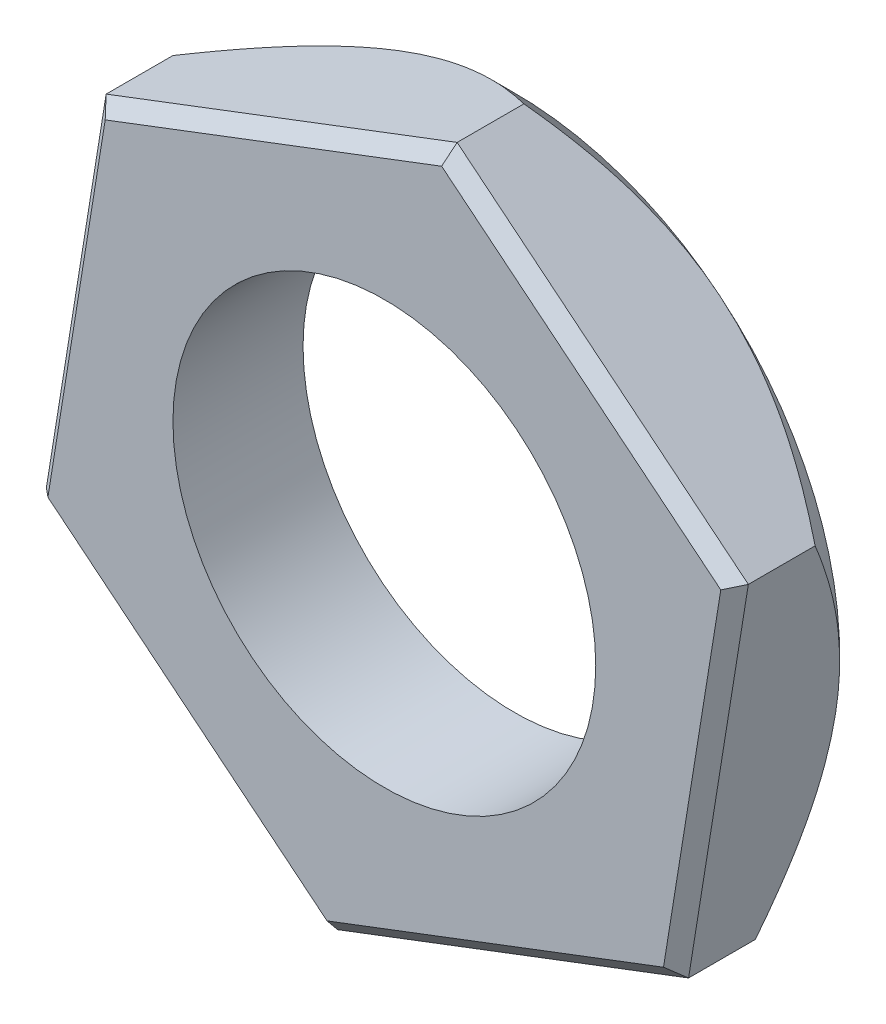
ISO-10303-21;
HEADER;
FILE_DESCRIPTION(('STEP AP214'),'2;1');
FILE_NAME('part.step','',(''),(''),'','','');
FILE_SCHEMA(('AUTOMOTIVE_DESIGN { 1 0 10303 214 1 1 1 1 }'));
ENDSEC;
DATA;
#1=APPLICATION_CONTEXT('core data for automotive mechanical design processes');
#2=APPLICATION_PROTOCOL_DEFINITION('international standard','automotive_design',2000,#1);
#3=PRODUCT_CONTEXT('',#1,'mechanical');
#4=PRODUCT('Part','Part','',(#3));
#5=PRODUCT_RELATED_PRODUCT_CATEGORY('part','',(#4));
#6=PRODUCT_DEFINITION_FORMATION('','',#4);
#7=PRODUCT_DEFINITION_CONTEXT('part definition',#1,'design');
#8=PRODUCT_DEFINITION('design','',#6,#7);
#9=PRODUCT_DEFINITION_SHAPE('','',#8);
#10=(LENGTH_UNIT() NAMED_UNIT(*) SI_UNIT(.MILLI.,.METRE.));
#11=(NAMED_UNIT(*) PLANE_ANGLE_UNIT() SI_UNIT($,.RADIAN.));
#12=(NAMED_UNIT(*) SI_UNIT($,.STERADIAN.) SOLID_ANGLE_UNIT());
#13=UNCERTAINTY_MEASURE_WITH_UNIT(LENGTH_MEASURE(1.E-05),#10,'distance_accuracy_value','');
#14=(GEOMETRIC_REPRESENTATION_CONTEXT(3) GLOBAL_UNCERTAINTY_ASSIGNED_CONTEXT((#13)) GLOBAL_UNIT_ASSIGNED_CONTEXT((#10,
#11,#12)) REPRESENTATION_CONTEXT('',''));
#15=CARTESIAN_POINT('',(0.,0.,0.));
#16=DIRECTION('',(0.,0.,1.));
#17=DIRECTION('',(1.,0.,0.));
#18=AXIS2_PLACEMENT_3D('',#15,#16,#17);
#19=CARTESIAN_POINT('',(0.,0.,0.));
#20=DIRECTION('',(0.,0.,1.));
#21=DIRECTION('',(1.,0.,0.));
#22=AXIS2_PLACEMENT_3D('',#19,#20,#21);
#23=PLANE('',#22);
#24=CARTESIAN_POINT('',(0.,0.,0.));
#25=DIRECTION('',(0.,0.,1.));
#26=DIRECTION('',(1.,0.,0.));
#27=AXIS2_PLACEMENT_3D('',#24,#25,#26);
#28=CIRCLE('',#27,3.25);
#29=CARTESIAN_POINT('',(3.25,0.,0.));
#30=VERTEX_POINT('',#29);
#31=EDGE_CURVE('E320',#30,#30,#28,.T.);
#32=ORIENTED_EDGE('',*,*,#31,.T.);
#33=EDGE_LOOP('',(#32));
#34=FACE_BOUND('',#33,.T.);
#35=CARTESIAN_POINT('',(0.,0.,0.));
#36=DIRECTION('',(0.,0.,-1.));
#37=DIRECTION('',(-1.,0.,0.));
#38=AXIS2_PLACEMENT_3D('',#35,#36,#37);
#39=CIRCLE('',#38,5.);
#40=CARTESIAN_POINT('',(-1.77905213864237,4.67279076013382,0.));
#41=VERTEX_POINT('',#40);
#42=CARTESIAN_POINT('',(3.1572294355239,3.87709972678824,0.));
#43=VERTEX_POINT('',#42);
#44=EDGE_CURVE('E136',#41,#43,#39,.T.);
#45=ORIENTED_EDGE('',*,*,#44,.T.);
#46=CARTESIAN_POINT('',(4.93628157416627,-0.795691033345577,0.));
#47=VERTEX_POINT('',#46);
#48=EDGE_CURVE('E125',#43,#47,#39,.T.);
#49=ORIENTED_EDGE('',*,*,#48,.T.);
#50=CARTESIAN_POINT('',(1.77905213864238,-4.67279076013382,0.));
#51=VERTEX_POINT('',#50);
#52=EDGE_CURVE('E137',#47,#51,#39,.T.);
#53=ORIENTED_EDGE('',*,*,#52,.T.);
#54=CARTESIAN_POINT('',(-3.15722943552389,-3.87709972678824,0.));
#55=VERTEX_POINT('',#54);
#56=EDGE_CURVE('E279',#51,#55,#39,.T.);
#57=ORIENTED_EDGE('',*,*,#56,.T.);
#58=CARTESIAN_POINT('',(-4.93628157416627,0.795691033345573,0.));
#59=VERTEX_POINT('',#58);
#60=EDGE_CURVE('E158',#55,#59,#39,.T.);
#61=ORIENTED_EDGE('',*,*,#60,.T.);
#62=EDGE_CURVE('E150',#59,#41,#39,.T.);
#63=ORIENTED_EDGE('',*,*,#62,.T.);
#64=EDGE_LOOP('',(#45,#49,#53,#57,#61,#63));
#65=FACE_BOUND('',#64,.T.);
#66=ADVANCED_FACE('F34',(#34,#65),#23,.F.);
#67=CARTESIAN_POINT('',(-4.47688914187243,3.64565452898627,2.));
#68=DIRECTION('',(0.987256314833254,-0.159138206669115,0.));
#69=DIRECTION('',(0.159138206669115,0.987256314833254,0.));
#70=AXIS2_PLACEMENT_3D('',#67,#68,#69);
#71=PLANE('',#70);
#72=DIRECTION('',(0.,0.,-1.));
#73=VECTOR('',#72,1.);
#74=CARTESIAN_POINT('',(-5.3956740064601,-2.05427246229511,2.));
#75=LINE('',#74,#73);
#76=CARTESIAN_POINT('',(-5.3956740064601,-2.05427246229511,1.8));
#77=VERTEX_POINT('',#76);
#78=CARTESIAN_POINT('',(-5.3956740064601,-2.05427246229511,0.773502691896245));
#79=VERTEX_POINT('',#78);
#80=EDGE_CURVE('E311',#77,#79,#75,.T.);
#81=ORIENTED_EDGE('',*,*,#80,.F.);
#82=DIRECTION('',(0.159138206669115,0.987256314833254,0.));
#83=VECTOR('',#82,1.);
#84=CARTESIAN_POINT('',(-4.47688914187243,3.64565452898627,1.8));
#85=LINE('',#84,#83);
#86=CARTESIAN_POINT('',(-4.47688914187243,3.64565452898627,1.8));
#87=VERTEX_POINT('',#86);
#88=EDGE_CURVE('E43',#77,#87,#85,.T.);
#89=ORIENTED_EDGE('',*,*,#88,.T.);
#90=DIRECTION('',(0.,0.,-1.));
#91=VECTOR('',#90,1.);
#92=CARTESIAN_POINT('',(-4.47688914187243,3.64565452898627,2.));
#93=LINE('',#92,#91);
#94=CARTESIAN_POINT('',(-4.47688914187243,3.64565452898627,0.773502691896249));
#95=VERTEX_POINT('',#94);
#96=EDGE_CURVE('E261',#87,#95,#93,.T.);
#97=ORIENTED_EDGE('',*,*,#96,.T.);
#98=CARTESIAN_POINT('',(-5.39570624493846,-2.05447246229511,0.773603985380079));
#99=CARTESIAN_POINT('',(-5.37990828535588,-1.95646560595417,0.72397285033257));
#100=CARTESIAN_POINT('',(-5.36398889478862,-1.85770542010827,0.675864812806547));
#101=CARTESIAN_POINT('',(-5.331883428467,-1.65853059572059,0.583158255487634));
#102=CARTESIAN_POINT('',(-5.31569721281281,-1.55811508927293,0.53856165245695));
#103=CARTESIAN_POINT('',(-5.26655221862284,-1.25323100849795,0.410353673917441));
#104=CARTESIAN_POINT('',(-5.23317740223007,-1.04618143234764,0.33287107448098));
#105=CARTESIAN_POINT('',(-5.1658744149064,-0.628649397563627,0.200187428722699));
#106=CARTESIAN_POINT('',(-5.13196344630485,-0.418273658168715,0.144652105392841));
#107=CARTESIAN_POINT('',(-5.08053948212892,-0.0992513791756916,0.0804113577927177));
#108=CARTESIAN_POINT('',(-5.06332245046184,0.00755906937582048,0.0621834059785219));
#109=CARTESIAN_POINT('',(-5.02874260781945,0.222084347303721,0.0324940647279748));
#110=CARTESIAN_POINT('',(-5.01137981902437,0.329799039079164,0.0210316640346012));
#111=CARTESIAN_POINT('',(-4.96906921569646,0.592284153082797,0.00181334794427144));
#112=CARTESIAN_POINT('',(-4.94407581347038,0.74733739072657,-0.00221906551645336));
#113=CARTESIAN_POINT('',(-4.89413405452889,1.05716441417283,0.00454880191539594));
#114=CARTESIAN_POINT('',(-4.86918571667283,1.21193808297632,0.015354282269621));
#115=CARTESIAN_POINT('',(-4.81952424835932,1.52002624874503,0.0511609953830387));
#116=CARTESIAN_POINT('',(-4.79481141241852,1.67333891859756,0.0761781035664301));
#117=CARTESIAN_POINT('',(-4.74581049334059,1.97732919098329,0.139047982880621));
#118=CARTESIAN_POINT('',(-4.72152237778431,2.12800699463731,0.17689976979624));
#119=CARTESIAN_POINT('',(-4.67840639539026,2.39548849251082,0.254772950518885));
#120=CARTESIAN_POINT('',(-4.6594830610612,2.51288444477833,0.292746394018213));
#121=CARTESIAN_POINT('',(-4.62197609245859,2.7455689294048,0.374812647595885));
#122=CARTESIAN_POINT('',(-4.60339246851088,2.8608573977046,0.418905643335503));
#123=CARTESIAN_POINT('',(-4.56662345225735,3.08896379808638,0.512222579898621));
#124=CARTESIAN_POINT('',(-4.54843701421571,3.20178821766949,0.561430385197737));
#125=CARTESIAN_POINT('',(-4.51240090460815,3.42534783617175,0.664330881237279));
#126=CARTESIAN_POINT('',(-4.49455103461817,3.53608426606757,0.718020821301213));
#127=CARTESIAN_POINT('',(-4.47685690339407,3.64585452898627,0.773603985380083));
#128=B_SPLINE_CURVE_WITH_KNOTS('',3,(#98,#99,#100,#101,#102,#103,#104,#105,#106,#107,#108,#109,
#110,#111,#112,#113,#114,#115,#116,#117,#118,#119,#120,#121,#122,#123,#124,#125,#126,#127),
.UNSPECIFIED.,.F.,.F.,(4,2,2,2,2,2,2,2,2,2,2,2,2,2,4),(0.,0.332942258609129,0.666065015968434,
1.33590706242885,1.99511252166244,2.32406874369522,2.65297578369077,3.12356282013711,
3.59431480073053,4.06559368258843,4.53683643304182,4.91114298755202,5.28546090064319,
5.65863187874306,6.03157550285055),.UNSPECIFIED.);
#129=EDGE_CURVE('E149',#59,#95,#128,.T.);
#130=ORIENTED_EDGE('',*,*,#129,.F.);
#131=EDGE_CURVE('E155',#79,#59,#128,.T.);
#132=ORIENTED_EDGE('',*,*,#131,.F.);
#133=EDGE_LOOP('',(#81,#89,#97,#130,#132));
#134=FACE_BOUND('',#133,.T.);
#135=ADVANCED_FACE('F214',(#134),#71,.F.);
#136=CARTESIAN_POINT('',(-5.3956740064601,-2.05427246229511,2.));
#137=DIRECTION('',(0.631445887104779,0.775419945357648,0.));
#138=DIRECTION('',(-0.775419945357648,0.631445887104779,0.));
#139=AXIS2_PLACEMENT_3D('',#136,#137,#138);
#140=PLANE('',#139);
#141=DIRECTION('',(0.,0.,-1.));
#142=VECTOR('',#141,1.);
#143=CARTESIAN_POINT('',(-0.918784864587673,-5.69992699128137,2.));
#144=LINE('',#143,#142);
#145=CARTESIAN_POINT('',(-0.918784864587673,-5.69992699128137,1.8));
#146=VERTEX_POINT('',#145);
#147=CARTESIAN_POINT('',(-0.918784864587673,-5.69992699128137,0.773502691896252));
#148=VERTEX_POINT('',#147);
#149=EDGE_CURVE('E312',#146,#148,#144,.T.);
#150=ORIENTED_EDGE('',*,*,#149,.F.);
#151=DIRECTION('',(-0.775419945357648,0.631445887104779,0.));
#152=VECTOR('',#151,1.);
#153=CARTESIAN_POINT('',(-5.3956740064601,-2.05427246229511,1.8));
#154=LINE('',#153,#152);
#155=EDGE_CURVE('E58',#146,#77,#154,.T.);
#156=ORIENTED_EDGE('',*,*,#155,.T.);
#157=ORIENTED_EDGE('',*,*,#80,.T.);
#158=CARTESIAN_POINT('',(-0.918584864587673,-5.70008985680757,0.773631658594961));
#159=CARTESIAN_POINT('',(-0.995563605871024,-5.63740394078376,0.723998976215254));
#160=CARTESIAN_POINT('',(-1.07313405041158,-5.57423618444828,0.675889411018732));
#161=CARTESIAN_POINT('',(-1.22957443703417,-5.44684245502293,0.583179854846174));
#162=CARTESIAN_POINT('',(-1.30844506083946,-5.38261592678697,0.538581780728499));
#163=CARTESIAN_POINT('',(-1.54791411579233,-5.18760965857818,0.410369462227134));
#164=CARTESIAN_POINT('',(-1.71053981502556,-5.05517905818783,0.332884116564412));
#165=CARTESIAN_POINT('',(-2.03848757869879,-4.7881221327161,0.200195640062594));
#166=CARTESIAN_POINT('',(-2.20372581509662,-4.6535640711257,0.144658208167137));
#167=CARTESIAN_POINT('',(-2.4542998541133,-4.44951470755234,0.0804149254963863));
#168=CARTESIAN_POINT('',(-2.53819345831217,-4.38119782759211,0.0621862342483763));
#169=CARTESIAN_POINT('',(-2.7066910351602,-4.2439855950144,0.0324956538378238));
#170=CARTESIAN_POINT('',(-2.79129489971842,-4.17509033041836,0.0210327533004237));
#171=CARTESIAN_POINT('',(-2.99746010047066,-4.00720431090272,0.00181374936369778));
#172=CARTESIAN_POINT('',(-3.11924356609716,-3.90803266984859,-0.00221897638376468));
#173=CARTESIAN_POINT('',(-3.36259103085079,-3.70986810537484,0.0045483025111792));
#174=CARTESIAN_POINT('',(-3.48415493808896,-3.61087525678295,0.0153535067560873));
#175=CARTESIAN_POINT('',(-3.72613670058024,-3.4138228213971,0.0511597199350075));
#176=CARTESIAN_POINT('',(-3.84655312068625,-3.31576440328309,0.0761766054147195));
#177=CARTESIAN_POINT('',(-4.08531630797688,-3.12133294261547,0.139046097796503));
#178=CARTESIAN_POINT('',(-4.20366323311952,-3.02495977143227,0.176897720527023));
#179=CARTESIAN_POINT('',(-4.41375556177589,-2.85387578315397,0.25477222494053));
#180=CARTESIAN_POINT('',(-4.50596606949126,-2.77878621885619,0.292747464177998));
#181=CARTESIAN_POINT('',(-4.68873170335424,-2.62995511321105,0.374817859296279));
#182=CARTESIAN_POINT('',(-4.77928677909673,-2.55621361290996,0.418913201173826));
#183=CARTESIAN_POINT('',(-4.95845634135226,-2.41031088773769,0.512235259951131));
#184=CARTESIAN_POINT('',(-5.04707592365872,-2.33814551322111,0.561445840472175));
#185=CARTESIAN_POINT('',(-5.22267400080559,-2.19515114705639,0.664352218675704));
#186=CARTESIAN_POINT('',(-5.30965346277337,-2.1243213678497,0.718045264912606));
#187=CARTESIAN_POINT('',(-5.3958740064601,-2.05410959676892,0.773631658594954));
#188=B_SPLINE_CURVE_WITH_KNOTS('',3,(#158,#159,#160,#161,#162,#163,#164,#165,#166,#167,#168,
#169,#170,#171,#172,#173,#174,#175,#176,#177,#178,#179,#180,#181,#182,#183,#184,#185,#186,#187),
.UNSPECIFIED.,.F.,.F.,(4,2,2,2,2,2,2,2,2,2,2,2,2,2,4),(0.,0.332948811205332,0.666078130797143,
1.33593358429308,1.99515175665752,2.32411428241964,2.65302762121182,3.12361516086703,
3.59436764891164,4.06564707408729,4.5368903695827,4.91121437560114,5.285549760235,
5.65873818995851,6.03169920858849),.UNSPECIFIED.);
#189=EDGE_CURVE('E197',#55,#79,#188,.T.);
#190=ORIENTED_EDGE('',*,*,#189,.F.);
#191=EDGE_CURVE('E203',#148,#55,#188,.T.);
#192=ORIENTED_EDGE('',*,*,#191,.F.);
#193=EDGE_LOOP('',(#150,#156,#157,#190,#192));
#194=FACE_BOUND('',#193,.T.);
#195=ADVANCED_FACE('F210',(#194),#140,.F.);
#196=CARTESIAN_POINT('',(-0.918784864587673,-5.69992699128137,2.));
#197=DIRECTION('',(-0.355810427728475,0.934558152026764,0.));
#198=DIRECTION('',(-0.934558152026764,-0.355810427728475,0.));
#199=AXIS2_PLACEMENT_3D('',#196,#197,#198);
#200=PLANE('',#199);
#201=DIRECTION('',(0.,0.,-1.));
#202=VECTOR('',#201,1.);
#203=CARTESIAN_POINT('',(4.47688914187243,-3.64565452898627,2.));
#204=LINE('',#203,#202);
#205=CARTESIAN_POINT('',(4.47688914187243,-3.64565452898627,1.8));
#206=VERTEX_POINT('',#205);
#207=CARTESIAN_POINT('',(4.47688914187243,-3.64565452898627,0.773502691896254));
#208=VERTEX_POINT('',#207);
#209=EDGE_CURVE('E314',#206,#208,#204,.T.);
#210=ORIENTED_EDGE('',*,*,#209,.F.);
#211=DIRECTION('',(-0.934558152026764,-0.355810427728475,0.));
#212=VECTOR('',#211,1.);
#213=CARTESIAN_POINT('',(-0.918784864587673,-5.69992699128137,1.8));
#214=LINE('',#213,#212);
#215=EDGE_CURVE('E297',#206,#146,#214,.T.);
#216=ORIENTED_EDGE('',*,*,#215,.T.);
#217=ORIENTED_EDGE('',*,*,#149,.T.);
#218=CARTESIAN_POINT('',(4.47708914187243,-3.64557838382035,0.773609697308102));
#219=CARTESIAN_POINT('',(4.38431341290819,-3.68090050019588,0.723978242883002));
#220=CARTESIAN_POINT('',(4.29082456191776,-3.71649412054642,0.675869890037632));
#221=CARTESIAN_POINT('',(4.10228070881357,-3.78827763543321,0.58316271373922));
#222=CARTESIAN_POINT('',(4.00722488511025,-3.82446784276981,0.538565807068231));
#223=CARTESIAN_POINT('',(3.71861398581189,-3.93434946683327,0.410356932737147));
#224=CARTESIAN_POINT('',(3.52261565976664,-4.00897109211468,0.332873766464515));
#225=CARTESIAN_POINT('',(3.12736934730612,-4.15945157231775,0.200189123612537));
#226=CARTESIAN_POINT('',(2.92822238552665,-4.23527196455114,0.144653365061576));
#227=CARTESIAN_POINT('',(2.62622785538643,-4.35024908256977,0.0804120942050887));
#228=CARTESIAN_POINT('',(2.52511839009278,-4.38874406762287,0.0621839897661531));
#229=CARTESIAN_POINT('',(2.32204334279953,-4.46605998347219,0.0324943927425218));
#230=CARTESIAN_POINT('',(2.22007789105971,-4.50488086467513,0.0210318888764828));
#231=CARTESIAN_POINT('',(1.97160338329359,-4.59948152777582,0.00181343080414));
#232=CARTESIAN_POINT('',(1.82482660859734,-4.65536323708627,-0.00221904711893458));
#233=CARTESIAN_POINT('',(1.53153758859728,-4.76702594253481,0.00454869882595687));
#234=CARTESIAN_POINT('',(1.38502545404588,-4.82280689650657,0.015354122184644));
#235=CARTESIAN_POINT('',(1.09338246250319,-4.93384291640515,0.051160732098622));
#236=CARTESIAN_POINT('',(0.948253335115995,-4.989097323827,0.0761777943095992));
#237=CARTESIAN_POINT('',(0.660489490510607,-5.09865645228977,0.139047593748669));
#238=CARTESIAN_POINT('',(0.517854582909122,-5.15296124581453,0.176899346770588));
#239=CARTESIAN_POINT('',(0.264649688189689,-5.24936288941229,0.254772800710026));
#240=CARTESIAN_POINT('',(0.153519074863463,-5.29167318436352,0.292746614864332));
#241=CARTESIAN_POINT('',(-0.066747184667469,-5.37553423875365,0.374813723289037));
#242=CARTESIAN_POINT('',(-0.175882770209708,-5.41708497509678,0.418907203289946));
#243=CARTESIAN_POINT('',(-0.391815239061008,-5.49929604343514,0.512225197118304));
#244=CARTESIAN_POINT('',(-0.498618263658515,-5.53995871357751,0.561433575245017));
#245=CARTESIAN_POINT('',(-0.710246573500962,-5.62053107740655,0.664335285409892));
#246=CARTESIAN_POINT('',(-0.815073024085237,-5.660441214768,0.718025866612823));
#247=CARTESIAN_POINT('',(-0.918984864587673,-5.70000313644729,0.773609697308099));
#248=B_SPLINE_CURVE_WITH_KNOTS('',3,(#218,#219,#220,#221,#222,#223,#224,#225,#226,#227,#228,
#229,#230,#231,#232,#233,#234,#235,#236,#237,#238,#239,#240,#241,#242,#243,#244,#245,#246,#247),
.UNSPECIFIED.,.F.,.F.,(4,2,2,2,2,2,2,2,2,2,2,2,2,2,4),(0.,0.332943611096375,0.666067722931879,
1.33591253666756,1.99512061995379,2.32407814310749,2.65298648320583,3.12357362350935,
3.59432570883553,4.06560470282939,4.53684756577468,4.91115772244533,5.28547924183195,
5.65865382211516,6.03160103662041),.UNSPECIFIED.);
#249=EDGE_CURVE('E204',#51,#148,#248,.T.);
#250=ORIENTED_EDGE('',*,*,#249,.F.);
#251=EDGE_CURVE('E321',#208,#51,#248,.T.);
#252=ORIENTED_EDGE('',*,*,#251,.F.);
#253=EDGE_LOOP('',(#210,#216,#217,#250,#252));
#254=FACE_BOUND('',#253,.T.);
#255=ADVANCED_FACE('F213',(#254),#200,.F.);
#256=CARTESIAN_POINT('',(4.47688914187243,-3.64565452898627,2.));
#257=DIRECTION('',(-0.987256314833254,0.159138206669115,0.));
#258=DIRECTION('',(-0.159138206669115,-0.987256314833254,0.));
#259=AXIS2_PLACEMENT_3D('',#256,#257,#258);
#260=PLANE('',#259);
#261=DIRECTION('',(0.,0.,-1.));
#262=VECTOR('',#261,1.);
#263=CARTESIAN_POINT('',(5.39567400646011,2.05427246229511,2.));
#264=LINE('',#263,#262);
#265=CARTESIAN_POINT('',(5.39567400646011,2.05427246229511,1.8));
#266=VERTEX_POINT('',#265);
#267=CARTESIAN_POINT('',(5.39567400646011,2.05427246229511,0.773502691896252));
#268=VERTEX_POINT('',#267);
#269=EDGE_CURVE('E154',#266,#268,#264,.T.);
#270=ORIENTED_EDGE('',*,*,#269,.F.);
#271=DIRECTION('',(-0.159138206669115,-0.987256314833254,0.));
#272=VECTOR('',#271,1.);
#273=CARTESIAN_POINT('',(4.47688914187243,-3.64565452898627,1.8));
#274=LINE('',#273,#272);
#275=EDGE_CURVE('E295',#266,#206,#274,.T.);
#276=ORIENTED_EDGE('',*,*,#275,.T.);
#277=ORIENTED_EDGE('',*,*,#209,.T.);
#278=CARTESIAN_POINT('',(5.39570624493846,2.05447246229511,0.773603985380087));
#279=CARTESIAN_POINT('',(5.37990828535589,1.95646560595417,0.723972850332577));
#280=CARTESIAN_POINT('',(5.36398889478863,1.85770542010827,0.675864812806554));
#281=CARTESIAN_POINT('',(5.33188342846701,1.65853059572059,0.58315825548764));
#282=CARTESIAN_POINT('',(5.31569721281282,1.55811508927293,0.538561652456957));
#283=CARTESIAN_POINT('',(5.26655221862284,1.25323100849794,0.410353673917447));
#284=CARTESIAN_POINT('',(5.23317740223008,1.04618143234763,0.332871074480986));
#285=CARTESIAN_POINT('',(5.16587441490641,0.628649397563623,0.200187428722705));
#286=CARTESIAN_POINT('',(5.13196344630485,0.41827365816871,0.144652105392847));
#287=CARTESIAN_POINT('',(5.08053948212893,0.0992513791756861,0.0804113577927235));
#288=CARTESIAN_POINT('',(5.06332245046184,-0.00755906937582606,0.0621834059785275));
#289=CARTESIAN_POINT('',(5.02874260781945,-0.222084347303727,0.03249406472798));
#290=CARTESIAN_POINT('',(5.01137981902437,-0.32979903907917,0.0210316640346062));
#291=CARTESIAN_POINT('',(4.96906921569647,-0.592284153082804,0.00181334794427639));
#292=CARTESIAN_POINT('',(4.94407581347038,-0.747337390726577,-0.00221906551644811));
#293=CARTESIAN_POINT('',(4.89413405452889,-1.05716441417284,0.00454880191540164));
#294=CARTESIAN_POINT('',(4.86918571667283,-1.21193808297633,0.0153542822696268));
#295=CARTESIAN_POINT('',(4.81952424835932,-1.52002624874504,0.0511609953830447));
#296=CARTESIAN_POINT('',(4.79481141241853,-1.67333891859756,0.076178103566436));
#297=CARTESIAN_POINT('',(4.7458104933406,-1.9773291909833,0.139047982880628));
#298=CARTESIAN_POINT('',(4.72152237778431,-2.12800699463732,0.176899769796248));
#299=CARTESIAN_POINT('',(4.67840639539027,-2.39548849251083,0.254772950518893));
#300=CARTESIAN_POINT('',(4.65948306106121,-2.51288444477834,0.292746394018221));
#301=CARTESIAN_POINT('',(4.62197609245859,-2.74556892940481,0.374812647595892));
#302=CARTESIAN_POINT('',(4.60339246851089,-2.86085739770461,0.41890564333551));
#303=CARTESIAN_POINT('',(4.56662345225736,-3.08896379808638,0.512222579898628));
#304=CARTESIAN_POINT('',(4.54843701421571,-3.2017882176695,0.561430385197743));
#305=CARTESIAN_POINT('',(4.51240090460816,-3.42534783617176,0.664330881237284));
#306=CARTESIAN_POINT('',(4.49455103461818,-3.53608426606757,0.718020821301217));
#307=CARTESIAN_POINT('',(4.47685690339408,-3.64585452898627,0.773603985380088));
#308=B_SPLINE_CURVE_WITH_KNOTS('',3,(#278,#279,#280,#281,#282,#283,#284,#285,#286,#287,#288,
#289,#290,#291,#292,#293,#294,#295,#296,#297,#298,#299,#300,#301,#302,#303,#304,#305,#306,#307),
.UNSPECIFIED.,.F.,.F.,(4,2,2,2,2,2,2,2,2,2,2,2,2,2,4),(0.,0.332942258609131,0.666065015968436,
1.33590706242885,1.99511252166244,2.32406874369523,2.65297578369078,3.12356282013712,
3.59431480073054,4.06559368258844,4.53683643304183,4.91114298755203,5.2854609006432,
5.65863187874306,6.03157550285056),.UNSPECIFIED.);
#309=EDGE_CURVE('E351',#47,#208,#308,.T.);
#310=ORIENTED_EDGE('',*,*,#309,.F.);
#311=EDGE_CURVE('E131',#268,#47,#308,.T.);
#312=ORIENTED_EDGE('',*,*,#311,.F.);
#313=EDGE_LOOP('',(#270,#276,#277,#310,#312));
#314=FACE_BOUND('',#313,.T.);
#315=ADVANCED_FACE('F259',(#314),#260,.F.);
#316=CARTESIAN_POINT('',(5.39567400646011,2.05427246229511,2.));
#317=DIRECTION('',(-0.631445887104779,-0.775419945357648,0.));
#318=DIRECTION('',(0.775419945357648,-0.631445887104779,0.));
#319=AXIS2_PLACEMENT_3D('',#316,#317,#318);
#320=PLANE('',#319);
#321=DIRECTION('',(0.,0.,-1.));
#322=VECTOR('',#321,1.);
#323=CARTESIAN_POINT('',(0.918784864587683,5.69992699128137,2.));
#324=LINE('',#323,#322);
#325=CARTESIAN_POINT('',(0.918784864587683,5.69992699128137,1.8));
#326=VERTEX_POINT('',#325);
#327=CARTESIAN_POINT('',(0.918784864587683,5.69992699128137,0.773502691896252));
#328=VERTEX_POINT('',#327);
#329=EDGE_CURVE('E266',#326,#328,#324,.T.);
#330=ORIENTED_EDGE('',*,*,#329,.F.);
#331=DIRECTION('',(0.775419945357648,-0.631445887104779,0.));
#332=VECTOR('',#331,1.);
#333=CARTESIAN_POINT('',(5.39567400646011,2.05427246229511,1.8));
#334=LINE('',#333,#332);
#335=EDGE_CURVE('E293',#326,#266,#334,.T.);
#336=ORIENTED_EDGE('',*,*,#335,.T.);
#337=ORIENTED_EDGE('',*,*,#269,.T.);
#338=CARTESIAN_POINT('',(0.918584864587683,5.70008985680757,0.773631658594961));
#339=CARTESIAN_POINT('',(0.995563605871034,5.63740394078376,0.723998976215254));
#340=CARTESIAN_POINT('',(1.07313405041159,5.57423618444828,0.675889411018733));
#341=CARTESIAN_POINT('',(1.22957443703418,5.44684245502293,0.583179854846175));
#342=CARTESIAN_POINT('',(1.30844506083947,5.38261592678697,0.538581780728501));
#343=CARTESIAN_POINT('',(1.54791411579234,5.18760965857818,0.410369462227136));
#344=CARTESIAN_POINT('',(1.71053981502557,5.05517905818783,0.332884116564415));
#345=CARTESIAN_POINT('',(2.0384875786988,4.7881221327161,0.200195640062598));
#346=CARTESIAN_POINT('',(2.20372581509662,4.65356407112571,0.144658208167142));
#347=CARTESIAN_POINT('',(2.45429985411331,4.44951470755235,0.0804149254963914));
#348=CARTESIAN_POINT('',(2.53819345831218,4.38119782759211,0.0621862342483813));
#349=CARTESIAN_POINT('',(2.7066910351602,4.2439855950144,0.0324956538378293));
#350=CARTESIAN_POINT('',(2.79129489971842,4.17509033041837,0.0210327533004299));
#351=CARTESIAN_POINT('',(2.99746010047067,4.00720431090272,0.00181374936370413));
#352=CARTESIAN_POINT('',(3.11924356609717,3.90803266984859,-0.00221897638375924));
#353=CARTESIAN_POINT('',(3.3625910308508,3.70986810537485,0.0045483025111846));
#354=CARTESIAN_POINT('',(3.48415493808896,3.61087525678295,0.0153535067560935));
#355=CARTESIAN_POINT('',(3.72613670058025,3.4138228213971,0.0511597199350139));
#356=CARTESIAN_POINT('',(3.84655312068626,3.31576440328309,0.0761766054147251));
#357=CARTESIAN_POINT('',(4.08531630797688,3.12133294261547,0.139046097796509));
#358=CARTESIAN_POINT('',(4.20366323311953,3.02495977143227,0.17689772052703));
#359=CARTESIAN_POINT('',(4.4137555617759,2.85387578315397,0.254772224940537));
#360=CARTESIAN_POINT('',(4.50596606949127,2.77878621885619,0.292747464178004));
#361=CARTESIAN_POINT('',(4.68873170335424,2.62995511321105,0.374817859296285));
#362=CARTESIAN_POINT('',(4.77928677909673,2.55621361290997,0.418913201173833));
#363=CARTESIAN_POINT('',(4.95845634135226,2.41031088773769,0.512235259951138));
#364=CARTESIAN_POINT('',(5.04707592365873,2.33814551322111,0.561445840472183));
#365=CARTESIAN_POINT('',(5.22267400080559,2.19515114705639,0.664352218675711));
#366=CARTESIAN_POINT('',(5.30965346277338,2.1243213678497,0.718045264912613));
#367=CARTESIAN_POINT('',(5.39587400646011,2.05410959676892,0.773631658594961));
#368=B_SPLINE_CURVE_WITH_KNOTS('',3,(#338,#339,#340,#341,#342,#343,#344,#345,#346,#347,#348,
#349,#350,#351,#352,#353,#354,#355,#356,#357,#358,#359,#360,#361,#362,#363,#364,#365,#366,#367),
.UNSPECIFIED.,.F.,.F.,(4,2,2,2,2,2,2,2,2,2,2,2,2,2,4),(0.,0.33294881120533,0.66607813079714,
1.33593358429307,1.99515175665751,2.32411428241963,2.65302762121181,3.12361516086702,
3.59436764891163,4.06564707408728,4.53689036958269,4.91121437560113,5.28554976023499,
5.6587381899585,6.03169920858849),.UNSPECIFIED.);
#369=EDGE_CURVE('E129',#43,#268,#368,.T.);
#370=ORIENTED_EDGE('',*,*,#369,.F.);
#371=EDGE_CURVE('E143',#328,#43,#368,.T.);
#372=ORIENTED_EDGE('',*,*,#371,.F.);
#373=EDGE_LOOP('',(#330,#336,#337,#370,#372));
#374=FACE_BOUND('',#373,.T.);
#375=ADVANCED_FACE('F152',(#374),#320,.F.);
#376=CARTESIAN_POINT('',(0.918784864587683,5.69992699128137,2.));
#377=DIRECTION('',(0.355810427728475,-0.934558152026764,0.));
#378=DIRECTION('',(0.934558152026764,0.355810427728475,0.));
#379=AXIS2_PLACEMENT_3D('',#376,#377,#378);
#380=PLANE('',#379);
#381=ORIENTED_EDGE('',*,*,#96,.F.);
#382=DIRECTION('',(0.934558152026764,0.355810427728475,0.));
#383=VECTOR('',#382,1.);
#384=CARTESIAN_POINT('',(0.918784864587683,5.69992699128137,1.8));
#385=LINE('',#384,#383);
#386=EDGE_CURVE('E12',#87,#326,#385,.T.);
#387=ORIENTED_EDGE('',*,*,#386,.T.);
#388=ORIENTED_EDGE('',*,*,#329,.T.);
#389=CARTESIAN_POINT('',(-4.47708914187243,3.64557838382035,0.773609697308097));
#390=CARTESIAN_POINT('',(-4.38431341290819,3.68090050019588,0.723978242882996));
#391=CARTESIAN_POINT('',(-4.29082456191776,3.71649412054642,0.675869890037626));
#392=CARTESIAN_POINT('',(-4.10228070881357,3.7882776354332,0.583162713739215));
#393=CARTESIAN_POINT('',(-4.00722488511025,3.82446784276981,0.538565807068227));
#394=CARTESIAN_POINT('',(-3.71861398581189,3.93434946683327,0.410356932737143));
#395=CARTESIAN_POINT('',(-3.52261565976664,4.00897109211467,0.332873766464511));
#396=CARTESIAN_POINT('',(-3.12736934730612,4.15945157231774,0.200189123612532));
#397=CARTESIAN_POINT('',(-2.92822238552665,4.23527196455113,0.144653365061571));
#398=CARTESIAN_POINT('',(-2.62622785538642,4.35024908256976,0.0804120942050841));
#399=CARTESIAN_POINT('',(-2.52511839009278,4.38874406762287,0.0621839897661487));
#400=CARTESIAN_POINT('',(-2.32204334279953,4.46605998347218,0.0324943927425171));
#401=CARTESIAN_POINT('',(-2.22007789105971,4.50488086467512,0.0210318888764777));
#402=CARTESIAN_POINT('',(-1.97160338329359,4.59948152777581,0.00181343080413479));
#403=CARTESIAN_POINT('',(-1.82482660859734,4.65536323708627,-0.00221904711893914));
#404=CARTESIAN_POINT('',(-1.53153758859728,4.7670259425348,0.00454869882595253));
#405=CARTESIAN_POINT('',(-1.38502545404588,4.82280689650657,0.0153541221846392));
#406=CARTESIAN_POINT('',(-1.09338246250319,4.93384291640514,0.0511607320986169));
#407=CARTESIAN_POINT('',(-0.948253335115995,4.98909732382699,0.0761777943095943));
#408=CARTESIAN_POINT('',(-0.660489490510607,5.09865645228977,0.139047593748664));
#409=CARTESIAN_POINT('',(-0.517854582909122,5.15296124581453,0.176899346770583));
#410=CARTESIAN_POINT('',(-0.264649688189689,5.24936288941229,0.254772800710022));
#411=CARTESIAN_POINT('',(-0.153519074863461,5.29167318436352,0.292746614864327));
#412=CARTESIAN_POINT('',(0.0667471846674725,5.37553423875365,0.374813723289034));
#413=CARTESIAN_POINT('',(0.175882770209713,5.41708497509677,0.418907203289944));
#414=CARTESIAN_POINT('',(0.391815239061014,5.49929604343514,0.512225197118303));
#415=CARTESIAN_POINT('',(0.498618263658522,5.53995871357751,0.561433575245016));
#416=CARTESIAN_POINT('',(0.710246573500971,5.62053107740655,0.664335285409891));
#417=CARTESIAN_POINT('',(0.815073024085247,5.660441214768,0.718025866612823));
#418=CARTESIAN_POINT('',(0.918984864587683,5.70000313644729,0.7736096973081));
#419=B_SPLINE_CURVE_WITH_KNOTS('',3,(#389,#390,#391,#392,#393,#394,#395,#396,#397,#398,#399,
#400,#401,#402,#403,#404,#405,#406,#407,#408,#409,#410,#411,#412,#413,#414,#415,#416,#417,#418),
.UNSPECIFIED.,.F.,.F.,(4,2,2,2,2,2,2,2,2,2,2,2,2,2,4),(0.,0.332943611096375,0.666067722931879,
1.33591253666755,1.99512061995379,2.32407814310748,2.65298648320583,3.12357362350935,
3.59432570883553,4.06560470282938,4.53684756577468,4.91115772244533,5.28547924183195,
5.65865382211516,6.03160103662042),.UNSPECIFIED.);
#420=EDGE_CURVE('E146',#41,#328,#419,.T.);
#421=ORIENTED_EDGE('',*,*,#420,.F.);
#422=EDGE_CURVE('E263',#95,#41,#419,.T.);
#423=ORIENTED_EDGE('',*,*,#422,.F.);
#424=EDGE_LOOP('',(#381,#387,#388,#421,#423));
#425=FACE_BOUND('',#424,.T.);
#426=ADVANCED_FACE('F250',(#425),#380,.F.);
#427=CARTESIAN_POINT('',(0.,0.,2.));
#428=DIRECTION('',(0.,0.,1.));
#429=DIRECTION('',(1.,0.,0.));
#430=AXIS2_PLACEMENT_3D('',#427,#428,#429);
#431=PLANE('',#430);
#432=DIRECTION('',(0.775419945357648,-0.631445887104779,0.));
#433=VECTOR('',#432,1.);
#434=CARTESIAN_POINT('',(-0.788008593064596,-5.53933281941424,2.));
#435=LINE('',#434,#433);
#436=CARTESIAN_POINT('',(-5.17217864657925,-1.96918200599544,2.));
#437=VERTEX_POINT('',#436);
#438=CARTESIAN_POINT('',(-0.880727681422371,-5.46382910384678,2.));
#439=VERTEX_POINT('',#438);
#440=EDGE_CURVE('E307',#437,#439,#435,.T.);
#441=ORIENTED_EDGE('',*,*,#440,.T.);
#442=DIRECTION('',(0.934558152026764,0.355810427728475,0.));
#443=VECTOR('',#442,1.);
#444=CARTESIAN_POINT('',(4.40319864509731,-3.45210186970151,2.));
#445=LINE('',#444,#443);
#446=CARTESIAN_POINT('',(4.29145096515688,-3.49464709785134,2.));
#447=VERTEX_POINT('',#446);
#448=EDGE_CURVE('E300',#439,#447,#445,.T.);
#449=ORIENTED_EDGE('',*,*,#448,.T.);
#450=DIRECTION('',(0.159138206669115,0.987256314833254,0.));
#451=VECTOR('',#450,1.);
#452=CARTESIAN_POINT('',(5.19120723816191,2.08723094971274,2.));
#453=LINE('',#452,#451);
#454=CARTESIAN_POINT('',(5.17217864657926,1.96918200599544,2.));
#455=VERTEX_POINT('',#454);
#456=EDGE_CURVE('E303',#447,#455,#453,.T.);
#457=ORIENTED_EDGE('',*,*,#456,.T.);
#458=DIRECTION('',(-0.775419945357648,0.631445887104779,0.));
#459=VECTOR('',#458,1.);
#460=CARTESIAN_POINT('',(0.788008593064607,5.53933281941424,2.));
#461=LINE('',#460,#459);
#462=CARTESIAN_POINT('',(0.880727681422382,5.46382910384678,2.));
#463=VERTEX_POINT('',#462);
#464=EDGE_CURVE('E305',#455,#463,#461,.T.);
#465=ORIENTED_EDGE('',*,*,#464,.T.);
#466=DIRECTION('',(-0.934558152026764,-0.355810427728475,0.));
#467=VECTOR('',#466,1.);
#468=CARTESIAN_POINT('',(-4.4031986450973,3.4521018697015,2.));
#469=LINE('',#468,#467);
#470=CARTESIAN_POINT('',(-4.29145096515687,3.49464709785134,2.));
#471=VERTEX_POINT('',#470);
#472=EDGE_CURVE('E309',#463,#471,#469,.T.);
#473=ORIENTED_EDGE('',*,*,#472,.T.);
#474=DIRECTION('',(-0.159138206669115,-0.987256314833254,0.));
#475=VECTOR('',#474,1.);
#476=CARTESIAN_POINT('',(-5.1912072381619,-2.08723094971274,2.));
#477=LINE('',#476,#475);
#478=EDGE_CURVE('E278',#471,#437,#477,.T.);
#479=ORIENTED_EDGE('',*,*,#478,.T.);
#480=EDGE_LOOP('',(#441,#449,#457,#465,#473,#479));
#481=FACE_BOUND('',#480,.T.);
#482=CARTESIAN_POINT('',(0.,0.,2.));
#483=DIRECTION('',(0.,0.,1.));
#484=DIRECTION('',(1.,0.,0.));
#485=AXIS2_PLACEMENT_3D('',#482,#483,#484);
#486=CIRCLE('',#485,3.25);
#487=CARTESIAN_POINT('',(3.25,0.,2.));
#488=VERTEX_POINT('',#487);
#489=EDGE_CURVE('E267',#488,#488,#486,.T.);
#490=ORIENTED_EDGE('',*,*,#489,.F.);
#491=EDGE_LOOP('',(#490));
#492=FACE_BOUND('',#491,.T.);
#493=ADVANCED_FACE('F249',(#481,#492),#431,.T.);
#494=CARTESIAN_POINT('',(0.,0.,2.));
#495=DIRECTION('',(0.,0.,-1.));
#496=DIRECTION('',(-1.,0.,0.));
#497=AXIS2_PLACEMENT_3D('',#494,#495,#496);
#498=CYLINDRICAL_SURFACE('',#497,3.25);
#499=ORIENTED_EDGE('',*,*,#489,.T.);
#500=EDGE_LOOP('',(#499));
#501=FACE_BOUND('',#500,.T.);
#502=ORIENTED_EDGE('',*,*,#31,.F.);
#503=EDGE_LOOP('',(#502));
#504=FACE_BOUND('',#503,.T.);
#505=ADVANCED_FACE('F179',(#501,#504),#498,.F.);
#506=CARTESIAN_POINT('',(0.,0.,0.));
#507=DIRECTION('',(0.,0.,1.));
#508=DIRECTION('',(-1.,0.,0.));
#509=AXIS2_PLACEMENT_3D('',#506,#507,#508);
#510=CONICAL_SURFACE('',#509,5.,0.78539816339745);
#511=ORIENTED_EDGE('',*,*,#371,.T.);
#512=ORIENTED_EDGE('',*,*,#44,.F.);
#513=ORIENTED_EDGE('',*,*,#420,.T.);
#514=EDGE_LOOP('',(#511,#512,#513));
#515=FACE_BOUND('',#514,.T.);
#516=ADVANCED_FACE('F144',(#515),#510,.T.);
#517=ORIENTED_EDGE('',*,*,#129,.T.);
#518=ORIENTED_EDGE('',*,*,#422,.T.);
#519=ORIENTED_EDGE('',*,*,#62,.F.);
#520=EDGE_LOOP('',(#517,#518,#519));
#521=FACE_BOUND('',#520,.T.);
#522=ADVANCED_FACE('F332',(#521),#510,.T.);
#523=ORIENTED_EDGE('',*,*,#311,.T.);
#524=ORIENTED_EDGE('',*,*,#48,.F.);
#525=ORIENTED_EDGE('',*,*,#369,.T.);
#526=EDGE_LOOP('',(#523,#524,#525));
#527=FACE_BOUND('',#526,.T.);
#528=ADVANCED_FACE('F127',(#527),#510,.T.);
#529=ORIENTED_EDGE('',*,*,#251,.T.);
#530=ORIENTED_EDGE('',*,*,#52,.F.);
#531=ORIENTED_EDGE('',*,*,#309,.T.);
#532=EDGE_LOOP('',(#529,#530,#531));
#533=FACE_BOUND('',#532,.T.);
#534=ADVANCED_FACE('F173',(#533),#510,.T.);
#535=ORIENTED_EDGE('',*,*,#249,.T.);
#536=ORIENTED_EDGE('',*,*,#191,.T.);
#537=ORIENTED_EDGE('',*,*,#56,.F.);
#538=EDGE_LOOP('',(#535,#536,#537));
#539=FACE_BOUND('',#538,.T.);
#540=ADVANCED_FACE('F177',(#539),#510,.T.);
#541=ORIENTED_EDGE('',*,*,#189,.T.);
#542=ORIENTED_EDGE('',*,*,#131,.T.);
#543=ORIENTED_EDGE('',*,*,#60,.F.);
#544=EDGE_LOOP('',(#541,#542,#543));
#545=FACE_BOUND('',#544,.T.);
#546=ADVANCED_FACE('F240',(#545),#510,.T.);
#547=CARTESIAN_POINT('',(-1.70536164186725,4.47923810084906,2.));
#548=DIRECTION('',(-0.247166691918181,0.649198642986083,0.719339800338651));
#549=DIRECTION('',(0.934558152026764,0.355810427728475,0.));
#550=AXIS2_PLACEMENT_3D('',#547,#548,#549);
#551=PLANE('',#550);
#552=DIRECTION('',(0.122074398922823,0.757321096791149,-0.641531446994364));
#553=VECTOR('',#552,1.);
#554=CARTESIAN_POINT('',(0.751164404127061,4.66004875243025,2.68088737273364));
#555=LINE('',#554,#553);
#556=EDGE_CURVE('E274',#326,#463,#555,.F.);
#557=ORIENTED_EDGE('',*,*,#556,.F.);
#558=ORIENTED_EDGE('',*,*,#386,.F.);
#559=DIRECTION('',(0.594822109181619,-0.484380079014454,0.641531446994363));
#560=VECTOR('',#559,1.);
#561=CARTESIAN_POINT('',(-3.66013840041503,2.98055183260776,2.68088737273364));
#562=LINE('',#561,#560);
#563=EDGE_CURVE('E38',#471,#87,#562,.F.);
#564=ORIENTED_EDGE('',*,*,#563,.F.);
#565=ORIENTED_EDGE('',*,*,#472,.F.);
#566=EDGE_LOOP('',(#557,#558,#564,#565));
#567=FACE_BOUND('',#566,.T.);
#568=ADVANCED_FACE('F36',(#567),#551,.T.);
#569=CARTESIAN_POINT('',(-4.73181480586806,0.762732545927946,2.));
#570=DIRECTION('',(-0.685805862887422,0.110546687322534,0.719339800338652));
#571=DIRECTION('',(0.159138206669115,0.987256314833254,0.));
#572=AXIS2_PLACEMENT_3D('',#569,#570,#571);
#573=PLANE('',#572);
#574=ORIENTED_EDGE('',*,*,#563,.T.);
#575=ORIENTED_EDGE('',*,*,#88,.F.);
#576=DIRECTION('',(0.716896508104441,0.272941017776693,0.641531446994363));
#577=VECTOR('',#576,1.);
#578=CARTESIAN_POINT('',(-4.4113028045421,-1.67949691982249,2.68088737273364));
#579=LINE('',#578,#577);
#580=EDGE_CURVE('E280',#437,#77,#579,.F.);
#581=ORIENTED_EDGE('',*,*,#580,.F.);
#582=ORIENTED_EDGE('',*,*,#478,.F.);
#583=EDGE_LOOP('',(#574,#575,#581,#582));
#584=FACE_BOUND('',#583,.T.);
#585=ADVANCED_FACE('F233',(#584),#573,.T.);
#586=CARTESIAN_POINT('',(3.02645316400082,3.71650555492111,2.));
#587=DIRECTION('',(0.438639170969242,0.538651955663549,0.719339800338651));
#588=DIRECTION('',(0.775419945357648,-0.631445887104779,0.));
#589=AXIS2_PLACEMENT_3D('',#586,#587,#588);
#590=PLANE('',#589);
#591=ORIENTED_EDGE('',*,*,#556,.T.);
#592=ORIENTED_EDGE('',*,*,#464,.F.);
#593=DIRECTION('',(0.71689650810444,0.272941017776695,-0.641531446994364));
#594=VECTOR('',#593,1.);
#595=CARTESIAN_POINT('',(4.41130280454211,1.67949691982249,2.68088737273364));
#596=LINE('',#595,#594);
#597=EDGE_CURVE('E282',#266,#455,#596,.F.);
#598=ORIENTED_EDGE('',*,*,#597,.F.);
#599=ORIENTED_EDGE('',*,*,#335,.F.);
#600=EDGE_LOOP('',(#591,#592,#598,#599));
#601=FACE_BOUND('',#600,.T.);
#602=ADVANCED_FACE('F230',(#601),#590,.T.);
#603=CARTESIAN_POINT('',(-3.02645316400082,-3.7165055549211,2.));
#604=DIRECTION('',(-0.438639170969242,-0.538651955663549,0.719339800338651));
#605=DIRECTION('',(-0.775419945357648,0.631445887104779,0.));
#606=AXIS2_PLACEMENT_3D('',#603,#604,#605);
#607=PLANE('',#606);
#608=ORIENTED_EDGE('',*,*,#580,.T.);
#609=ORIENTED_EDGE('',*,*,#155,.F.);
#610=DIRECTION('',(0.122074398922824,0.757321096791149,0.641531446994364));
#611=VECTOR('',#610,1.);
#612=CARTESIAN_POINT('',(-0.75116440412705,-4.66004875243025,2.68088737273364));
#613=LINE('',#612,#611);
#614=EDGE_CURVE('E287',#439,#146,#613,.F.);
#615=ORIENTED_EDGE('',*,*,#614,.F.);
#616=ORIENTED_EDGE('',*,*,#440,.F.);
#617=EDGE_LOOP('',(#608,#609,#615,#616));
#618=FACE_BOUND('',#617,.T.);
#619=ADVANCED_FACE('F226',(#618),#607,.T.);
#620=CARTESIAN_POINT('',(4.73181480586807,-0.76273254592795,2.));
#621=DIRECTION('',(0.685805862887424,-0.110546687322535,0.719339800338651));
#622=DIRECTION('',(-0.159138206669115,-0.987256314833254,0.));
#623=AXIS2_PLACEMENT_3D('',#620,#621,#622);
#624=PLANE('',#623);
#625=ORIENTED_EDGE('',*,*,#597,.T.);
#626=ORIENTED_EDGE('',*,*,#456,.F.);
#627=DIRECTION('',(0.594822109181616,-0.484380079014456,-0.641531446994364));
#628=VECTOR('',#627,1.);
#629=CARTESIAN_POINT('',(3.66013840041504,-2.98055183260776,2.68088737273364));
#630=LINE('',#629,#628);
#631=EDGE_CURVE('E289',#206,#447,#630,.F.);
#632=ORIENTED_EDGE('',*,*,#631,.F.);
#633=ORIENTED_EDGE('',*,*,#275,.F.);
#634=EDGE_LOOP('',(#625,#626,#632,#633));
#635=FACE_BOUND('',#634,.T.);
#636=ADVANCED_FACE('F222',(#635),#624,.T.);
#637=CARTESIAN_POINT('',(1.70536164186725,-4.47923810084906,2.));
#638=DIRECTION('',(0.247166691918181,-0.649198642986084,0.719339800338651));
#639=DIRECTION('',(-0.934558152026764,-0.355810427728475,0.));
#640=AXIS2_PLACEMENT_3D('',#637,#638,#639);
#641=PLANE('',#640);
#642=ORIENTED_EDGE('',*,*,#614,.T.);
#643=ORIENTED_EDGE('',*,*,#215,.F.);
#644=ORIENTED_EDGE('',*,*,#631,.T.);
#645=ORIENTED_EDGE('',*,*,#448,.F.);
#646=EDGE_LOOP('',(#642,#643,#644,#645));
#647=FACE_BOUND('',#646,.T.);
#648=ADVANCED_FACE('F219',(#647),#641,.T.);
#649=CLOSED_SHELL('',(#66,#135,#195,#255,#315,#375,#426,#493,#505,#516,#522,#528,#534,#540,#546,
#568,#585,#602,#619,#636,#648));
#650=MANIFOLD_SOLID_BREP('B2',#649);
#651=ADVANCED_BREP_SHAPE_REPRESENTATION('',(#18,#650),#14);
#652=SHAPE_DEFINITION_REPRESENTATION(#9,#651);
ENDSEC;
END-ISO-10303-21;
